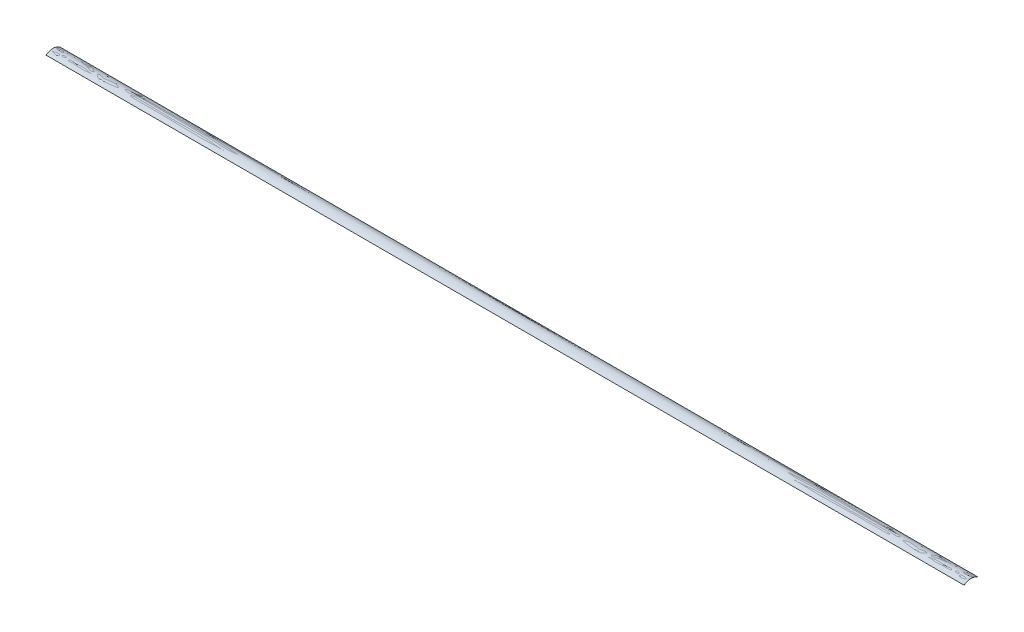
ISO-10303-21;
HEADER;
FILE_DESCRIPTION(('STEP AP214'),'2;1');
FILE_NAME('part.step','',(''),(''),'','','');
FILE_SCHEMA(('AUTOMOTIVE_DESIGN { 1 0 10303 214 1 1 1 1 }'));
ENDSEC;
DATA;
#1=APPLICATION_CONTEXT('core data for automotive mechanical design processes');
#2=APPLICATION_PROTOCOL_DEFINITION('international standard','automotive_design',2000,#1);
#3=PRODUCT_CONTEXT('',#1,'mechanical');
#4=PRODUCT('Part','Part','',(#3));
#5=PRODUCT_RELATED_PRODUCT_CATEGORY('part','',(#4));
#6=PRODUCT_DEFINITION_FORMATION('','',#4);
#7=PRODUCT_DEFINITION_CONTEXT('part definition',#1,'design');
#8=PRODUCT_DEFINITION('design','',#6,#7);
#9=PRODUCT_DEFINITION_SHAPE('','',#8);
#10=(LENGTH_UNIT() NAMED_UNIT(*) SI_UNIT(.MILLI.,.METRE.));
#11=(NAMED_UNIT(*) PLANE_ANGLE_UNIT() SI_UNIT($,.RADIAN.));
#12=(NAMED_UNIT(*) SI_UNIT($,.STERADIAN.) SOLID_ANGLE_UNIT());
#13=UNCERTAINTY_MEASURE_WITH_UNIT(LENGTH_MEASURE(1.E-05),#10,'distance_accuracy_value','');
#14=(GEOMETRIC_REPRESENTATION_CONTEXT(3) GLOBAL_UNCERTAINTY_ASSIGNED_CONTEXT((#13)) GLOBAL_UNIT_ASSIGNED_CONTEXT((#10,
#11,#12)) REPRESENTATION_CONTEXT('',''));
#15=CARTESIAN_POINT('',(0.,0.,0.));
#16=DIRECTION('',(0.,0.,1.));
#17=DIRECTION('',(1.,0.,0.));
#18=AXIS2_PLACEMENT_3D('',#15,#16,#17);
#19=CARTESIAN_POINT('',(495.3,0.,-7.55));
#20=CARTESIAN_POINT('',(495.3,5.1,0.));
#21=CARTESIAN_POINT('',(495.3,0.,7.55));
#22=B_SPLINE_CURVE_WITH_KNOTS('',2,(#19,#20,#21),.UNSPECIFIED.,.F.,.F.,(3,3),(0.,1.),.UNSPECIFIED.);
#23=DIRECTION('',(-1.,0.,0.));
#24=VECTOR('',#23,1.);
#25=SURFACE_OF_LINEAR_EXTRUSION('',#22,#24);
#26=CARTESIAN_POINT('',(-495.3,0.,-7.55));
#27=CARTESIAN_POINT('',(-495.3,5.1,0.));
#28=CARTESIAN_POINT('',(-495.3,0.,7.55));
#29=B_SPLINE_CURVE_WITH_KNOTS('',2,(#26,#27,#28),.UNSPECIFIED.,.F.,.F.,(3,3),(0.,1.),.UNSPECIFIED.);
#30=CARTESIAN_POINT('',(-495.3,0.,-7.55));
#31=VERTEX_POINT('',#30);
#32=CARTESIAN_POINT('',(-495.3,0.,7.55));
#33=VERTEX_POINT('',#32);
#34=EDGE_CURVE('E117',#31,#33,#29,.T.);
#35=ORIENTED_EDGE('',*,*,#34,.T.);
#36=DIRECTION('',(-1.,0.,0.));
#37=VECTOR('',#36,1.);
#38=CARTESIAN_POINT('',(495.3,0.,7.55));
#39=LINE('',#38,#37);
#40=CARTESIAN_POINT('',(495.3,0.,7.55));
#41=VERTEX_POINT('',#40);
#42=EDGE_CURVE('E11',#41,#33,#39,.T.);
#43=ORIENTED_EDGE('',*,*,#42,.F.);
#44=CARTESIAN_POINT('',(495.3,0.,-7.55));
#45=VERTEX_POINT('',#44);
#46=EDGE_CURVE('E86',#45,#41,#22,.T.);
#47=ORIENTED_EDGE('',*,*,#46,.F.);
#48=DIRECTION('',(-1.,0.,0.));
#49=VECTOR('',#48,1.);
#50=CARTESIAN_POINT('',(495.3,0.,-7.55));
#51=LINE('',#50,#49);
#52=EDGE_CURVE('E94',#45,#31,#51,.T.);
#53=ORIENTED_EDGE('',*,*,#52,.T.);
#54=EDGE_LOOP('',(#35,#43,#47,#53));
#55=FACE_BOUND('',#54,.T.);
#56=ADVANCED_FACE('F34',(#55),#25,.F.);
#57=CARTESIAN_POINT('',(495.3,0.,7.45));
#58=DIRECTION('',(0.,1.,0.));
#59=DIRECTION('',(0.,0.,1.));
#60=AXIS2_PLACEMENT_3D('',#57,#58,#59);
#61=PLANE('',#60);
#62=DIRECTION('',(0.,0.,-1.));
#63=VECTOR('',#62,1.);
#64=CARTESIAN_POINT('',(-495.3,0.,7.45));
#65=LINE('',#64,#63);
#66=CARTESIAN_POINT('',(-495.3,0.,7.45));
#67=VERTEX_POINT('',#66);
#68=EDGE_CURVE('E90',#33,#67,#65,.T.);
#69=ORIENTED_EDGE('',*,*,#68,.T.);
#70=DIRECTION('',(-1.,0.,0.));
#71=VECTOR('',#70,1.);
#72=CARTESIAN_POINT('',(495.3,0.,7.45));
#73=LINE('',#72,#71);
#74=CARTESIAN_POINT('',(495.3,0.,7.45));
#75=VERTEX_POINT('',#74);
#76=EDGE_CURVE('E43',#75,#67,#73,.T.);
#77=ORIENTED_EDGE('',*,*,#76,.F.);
#78=DIRECTION('',(0.,0.,-1.));
#79=VECTOR('',#78,1.);
#80=CARTESIAN_POINT('',(495.3,0.,7.45));
#81=LINE('',#80,#79);
#82=EDGE_CURVE('E81',#41,#75,#81,.T.);
#83=ORIENTED_EDGE('',*,*,#82,.F.);
#84=ORIENTED_EDGE('',*,*,#42,.T.);
#85=EDGE_LOOP('',(#69,#77,#83,#84));
#86=FACE_BOUND('',#85,.T.);
#87=ADVANCED_FACE('F89',(#86),#61,.F.);
#88=CARTESIAN_POINT('',(495.3,0.,7.45));
#89=CARTESIAN_POINT('',(495.3,4.9,0.));
#90=CARTESIAN_POINT('',(495.3,0.,-7.45));
#91=B_SPLINE_CURVE_WITH_KNOTS('',2,(#88,#89,#90),.UNSPECIFIED.,.F.,.F.,(3,3),(0.,1.),.UNSPECIFIED.);
#92=DIRECTION('',(-1.,0.,0.));
#93=VECTOR('',#92,1.);
#94=SURFACE_OF_LINEAR_EXTRUSION('',#91,#93);
#95=CARTESIAN_POINT('',(-495.3,0.,7.45));
#96=CARTESIAN_POINT('',(-495.3,4.9,0.));
#97=CARTESIAN_POINT('',(-495.3,0.,-7.45));
#98=B_SPLINE_CURVE_WITH_KNOTS('',2,(#95,#96,#97),.UNSPECIFIED.,.F.,.F.,(3,3),(0.,1.),.UNSPECIFIED.);
#99=CARTESIAN_POINT('',(-495.3,0.,-7.45));
#100=VERTEX_POINT('',#99);
#101=EDGE_CURVE('E68',#67,#100,#98,.T.);
#102=ORIENTED_EDGE('',*,*,#101,.T.);
#103=DIRECTION('',(-1.,0.,0.));
#104=VECTOR('',#103,1.);
#105=CARTESIAN_POINT('',(495.3,0.,-7.45));
#106=LINE('',#105,#104);
#107=CARTESIAN_POINT('',(495.3,0.,-7.45));
#108=VERTEX_POINT('',#107);
#109=EDGE_CURVE('E91',#108,#100,#106,.T.);
#110=ORIENTED_EDGE('',*,*,#109,.F.);
#111=EDGE_CURVE('E84',#75,#108,#91,.T.);
#112=ORIENTED_EDGE('',*,*,#111,.F.);
#113=ORIENTED_EDGE('',*,*,#76,.T.);
#114=EDGE_LOOP('',(#102,#110,#112,#113));
#115=FACE_BOUND('',#114,.T.);
#116=ADVANCED_FACE('F92',(#115),#94,.F.);
#117=CARTESIAN_POINT('',(495.3,0.,-7.55));
#118=DIRECTION('',(0.,1.,0.));
#119=DIRECTION('',(0.,0.,1.));
#120=AXIS2_PLACEMENT_3D('',#117,#118,#119);
#121=PLANE('',#120);
#122=DIRECTION('',(0.,0.,-1.));
#123=VECTOR('',#122,1.);
#124=CARTESIAN_POINT('',(-495.3,0.,-7.55));
#125=LINE('',#124,#123);
#126=EDGE_CURVE('E74',#100,#31,#125,.T.);
#127=ORIENTED_EDGE('',*,*,#126,.T.);
#128=ORIENTED_EDGE('',*,*,#52,.F.);
#129=DIRECTION('',(0.,0.,-1.));
#130=VECTOR('',#129,1.);
#131=CARTESIAN_POINT('',(495.3,0.,-7.55));
#132=LINE('',#131,#130);
#133=EDGE_CURVE('E51',#108,#45,#132,.T.);
#134=ORIENTED_EDGE('',*,*,#133,.F.);
#135=ORIENTED_EDGE('',*,*,#109,.T.);
#136=EDGE_LOOP('',(#127,#128,#134,#135));
#137=FACE_BOUND('',#136,.T.);
#138=ADVANCED_FACE('F106',(#137),#121,.F.);
#139=CARTESIAN_POINT('',(495.3,2.55,0.));
#140=DIRECTION('',(-1.,0.,0.));
#141=DIRECTION('',(0.,0.,1.));
#142=AXIS2_PLACEMENT_3D('',#139,#140,#141);
#143=PLANE('',#142);
#144=ORIENTED_EDGE('',*,*,#46,.T.);
#145=ORIENTED_EDGE('',*,*,#82,.T.);
#146=ORIENTED_EDGE('',*,*,#111,.T.);
#147=ORIENTED_EDGE('',*,*,#133,.T.);
#148=EDGE_LOOP('',(#144,#145,#146,#147));
#149=FACE_BOUND('',#148,.T.);
#150=ADVANCED_FACE('F82',(#149),#143,.F.);
#151=CARTESIAN_POINT('',(-495.3,2.55,0.));
#152=DIRECTION('',(-1.,0.,0.));
#153=DIRECTION('',(0.,0.,1.));
#154=AXIS2_PLACEMENT_3D('',#151,#152,#153);
#155=PLANE('',#154);
#156=ORIENTED_EDGE('',*,*,#34,.F.);
#157=ORIENTED_EDGE('',*,*,#126,.F.);
#158=ORIENTED_EDGE('',*,*,#101,.F.);
#159=ORIENTED_EDGE('',*,*,#68,.F.);
#160=EDGE_LOOP('',(#156,#157,#158,#159));
#161=FACE_BOUND('',#160,.T.);
#162=ADVANCED_FACE('F134',(#161),#155,.T.);
#163=CLOSED_SHELL('',(#56,#87,#116,#138,#150,#162));
#164=MANIFOLD_SOLID_BREP('B2',#163);
#165=ADVANCED_BREP_SHAPE_REPRESENTATION('',(#18,#164),#14);
#166=SHAPE_DEFINITION_REPRESENTATION(#9,#165);
ENDSEC;
END-ISO-10303-21;
